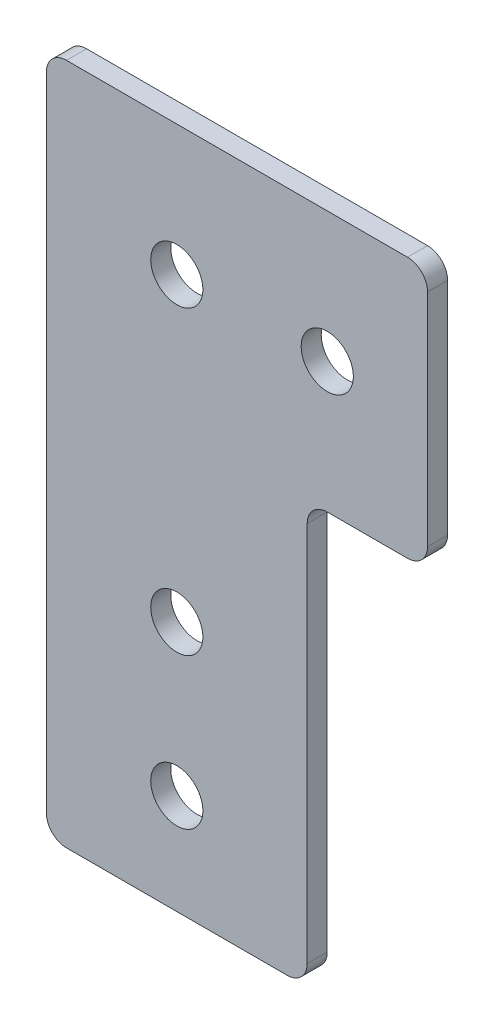
ISO-10303-21;
HEADER;
FILE_DESCRIPTION(('STEP AP214'),'2;1');
FILE_NAME('part.step','',(''),(''),'','','');
FILE_SCHEMA(('AUTOMOTIVE_DESIGN { 1 0 10303 214 1 1 1 1 }'));
ENDSEC;
DATA;
#1=APPLICATION_CONTEXT('core data for automotive mechanical design processes');
#2=APPLICATION_PROTOCOL_DEFINITION('international standard','automotive_design',2000,#1);
#3=PRODUCT_CONTEXT('',#1,'mechanical');
#4=PRODUCT('Part','Part','',(#3));
#5=PRODUCT_RELATED_PRODUCT_CATEGORY('part','',(#4));
#6=PRODUCT_DEFINITION_FORMATION('','',#4);
#7=PRODUCT_DEFINITION_CONTEXT('part definition',#1,'design');
#8=PRODUCT_DEFINITION('design','',#6,#7);
#9=PRODUCT_DEFINITION_SHAPE('','',#8);
#10=(LENGTH_UNIT() NAMED_UNIT(*) SI_UNIT(.MILLI.,.METRE.));
#11=(NAMED_UNIT(*) PLANE_ANGLE_UNIT() SI_UNIT($,.RADIAN.));
#12=(NAMED_UNIT(*) SI_UNIT($,.STERADIAN.) SOLID_ANGLE_UNIT());
#13=UNCERTAINTY_MEASURE_WITH_UNIT(LENGTH_MEASURE(1.E-05),#10,'distance_accuracy_value','');
#14=(GEOMETRIC_REPRESENTATION_CONTEXT(3) GLOBAL_UNCERTAINTY_ASSIGNED_CONTEXT((#13)) GLOBAL_UNIT_ASSIGNED_CONTEXT((#10,
#11,#12)) REPRESENTATION_CONTEXT('',''));
#15=CARTESIAN_POINT('',(0.,0.,0.));
#16=DIRECTION('',(0.,0.,1.));
#17=DIRECTION('',(1.,0.,0.));
#18=AXIS2_PLACEMENT_3D('',#15,#16,#17);
#19=CARTESIAN_POINT('',(11.,-53.,2.));
#20=DIRECTION('',(0.,0.,-1.));
#21=DIRECTION('',(-1.,0.,0.));
#22=AXIS2_PLACEMENT_3D('',#19,#20,#21);
#23=PLANE('',#22);
#24=CARTESIAN_POINT('',(0.,-45.,2.));
#25=DIRECTION('',(0.,0.,-1.));
#26=DIRECTION('',(-1.,0.,0.));
#27=AXIS2_PLACEMENT_3D('',#24,#25,#26);
#28=CIRCLE('',#27,2.6);
#29=CARTESIAN_POINT('',(-2.6,-45.,2.));
#30=VERTEX_POINT('',#29);
#31=EDGE_CURVE('E175',#30,#30,#28,.T.);
#32=ORIENTED_EDGE('',*,*,#31,.T.);
#33=EDGE_LOOP('',(#32));
#34=FACE_BOUND('',#33,.T.);
#35=CARTESIAN_POINT('',(0.,-30.,2.));
#36=DIRECTION('',(0.,0.,-1.));
#37=DIRECTION('',(-1.,0.,0.));
#38=AXIS2_PLACEMENT_3D('',#35,#36,#37);
#39=CIRCLE('',#38,2.6);
#40=CARTESIAN_POINT('',(-2.6,-30.,2.));
#41=VERTEX_POINT('',#40);
#42=EDGE_CURVE('E178',#41,#41,#39,.T.);
#43=ORIENTED_EDGE('',*,*,#42,.T.);
#44=EDGE_LOOP('',(#43));
#45=FACE_BOUND('',#44,.T.);
#46=CARTESIAN_POINT('',(15.,0.,2.));
#47=DIRECTION('',(0.,0.,-1.));
#48=DIRECTION('',(-1.,0.,0.));
#49=AXIS2_PLACEMENT_3D('',#46,#47,#48);
#50=CIRCLE('',#49,2.6);
#51=CARTESIAN_POINT('',(12.4,0.,2.));
#52=VERTEX_POINT('',#51);
#53=EDGE_CURVE('E181',#52,#52,#50,.T.);
#54=ORIENTED_EDGE('',*,*,#53,.T.);
#55=EDGE_LOOP('',(#54));
#56=FACE_BOUND('',#55,.T.);
#57=CARTESIAN_POINT('',(0.,0.,2.));
#58=DIRECTION('',(0.,0.,-1.));
#59=DIRECTION('',(-1.,0.,0.));
#60=AXIS2_PLACEMENT_3D('',#57,#58,#59);
#61=CIRCLE('',#60,2.6);
#62=CARTESIAN_POINT('',(-2.6,0.,2.));
#63=VERTEX_POINT('',#62);
#64=EDGE_CURVE('E122',#63,#63,#61,.T.);
#65=ORIENTED_EDGE('',*,*,#64,.T.);
#66=EDGE_LOOP('',(#65));
#67=FACE_BOUND('',#66,.T.);
#68=DIRECTION('',(0.,-1.,0.));
#69=VECTOR('',#68,1.);
#70=CARTESIAN_POINT('',(13.,-53.,2.));
#71=LINE('',#70,#69);
#72=CARTESIAN_POINT('',(13.,-53.,2.));
#73=VERTEX_POINT('',#72);
#74=CARTESIAN_POINT('',(13.,-15.,2.));
#75=VERTEX_POINT('',#74);
#76=EDGE_CURVE('E106',#73,#75,#71,.F.);
#77=ORIENTED_EDGE('',*,*,#76,.T.);
#78=CARTESIAN_POINT('',(15.,-15.,2.));
#79=DIRECTION('',(0.,0.,-1.));
#80=DIRECTION('',(-1.,0.,0.));
#81=AXIS2_PLACEMENT_3D('',#78,#79,#80);
#82=CIRCLE('',#81,2.);
#83=CARTESIAN_POINT('',(15.,-13.,2.));
#84=VERTEX_POINT('',#83);
#85=EDGE_CURVE('E186',#75,#84,#82,.T.);
#86=ORIENTED_EDGE('',*,*,#85,.T.);
#87=DIRECTION('',(1.,0.,0.));
#88=VECTOR('',#87,1.);
#89=CARTESIAN_POINT('',(15.,-13.,2.));
#90=LINE('',#89,#88);
#91=CARTESIAN_POINT('',(23.,-13.,2.));
#92=VERTEX_POINT('',#91);
#93=EDGE_CURVE('E128',#84,#92,#90,.T.);
#94=ORIENTED_EDGE('',*,*,#93,.T.);
#95=CARTESIAN_POINT('',(23.,-11.,2.));
#96=DIRECTION('',(0.,0.,-1.));
#97=DIRECTION('',(-1.,0.,0.));
#98=AXIS2_PLACEMENT_3D('',#95,#96,#97);
#99=CIRCLE('',#98,2.);
#100=CARTESIAN_POINT('',(25.,-11.,2.));
#101=VERTEX_POINT('',#100);
#102=EDGE_CURVE('E131',#101,#92,#99,.T.);
#103=ORIENTED_EDGE('',*,*,#102,.F.);
#104=DIRECTION('',(0.,1.,0.));
#105=VECTOR('',#104,1.);
#106=CARTESIAN_POINT('',(25.,11.,2.));
#107=LINE('',#106,#105);
#108=CARTESIAN_POINT('',(25.,11.,2.));
#109=VERTEX_POINT('',#108);
#110=EDGE_CURVE('E132',#101,#109,#107,.T.);
#111=ORIENTED_EDGE('',*,*,#110,.T.);
#112=CARTESIAN_POINT('',(23.,11.,2.));
#113=DIRECTION('',(0.,0.,-1.));
#114=DIRECTION('',(-1.,0.,0.));
#115=AXIS2_PLACEMENT_3D('',#112,#113,#114);
#116=CIRCLE('',#115,2.);
#117=CARTESIAN_POINT('',(23.,13.,2.));
#118=VERTEX_POINT('',#117);
#119=EDGE_CURVE('E135',#118,#109,#116,.T.);
#120=ORIENTED_EDGE('',*,*,#119,.F.);
#121=DIRECTION('',(1.,0.,0.));
#122=VECTOR('',#121,1.);
#123=CARTESIAN_POINT('',(-11.,13.,2.));
#124=LINE('',#123,#122);
#125=CARTESIAN_POINT('',(-11.,13.,2.));
#126=VERTEX_POINT('',#125);
#127=EDGE_CURVE('E136',#118,#126,#124,.F.);
#128=ORIENTED_EDGE('',*,*,#127,.T.);
#129=CARTESIAN_POINT('',(-11.,11.,2.));
#130=DIRECTION('',(0.,0.,-1.));
#131=DIRECTION('',(-1.,0.,0.));
#132=AXIS2_PLACEMENT_3D('',#129,#130,#131);
#133=CIRCLE('',#132,2.);
#134=CARTESIAN_POINT('',(-13.,11.,2.));
#135=VERTEX_POINT('',#134);
#136=EDGE_CURVE('E139',#135,#126,#133,.T.);
#137=ORIENTED_EDGE('',*,*,#136,.F.);
#138=DIRECTION('',(0.,1.,0.));
#139=VECTOR('',#138,1.);
#140=CARTESIAN_POINT('',(-13.,-53.,2.));
#141=LINE('',#140,#139);
#142=CARTESIAN_POINT('',(-13.,-53.,2.));
#143=VERTEX_POINT('',#142);
#144=EDGE_CURVE('E140',#135,#143,#141,.F.);
#145=ORIENTED_EDGE('',*,*,#144,.T.);
#146=CARTESIAN_POINT('',(-11.,-53.,2.));
#147=DIRECTION('',(0.,0.,-1.));
#148=DIRECTION('',(-1.,0.,0.));
#149=AXIS2_PLACEMENT_3D('',#146,#147,#148);
#150=CIRCLE('',#149,2.);
#151=CARTESIAN_POINT('',(-11.,-55.,2.));
#152=VERTEX_POINT('',#151);
#153=EDGE_CURVE('E143',#152,#143,#150,.T.);
#154=ORIENTED_EDGE('',*,*,#153,.F.);
#155=DIRECTION('',(-1.,0.,0.));
#156=VECTOR('',#155,1.);
#157=CARTESIAN_POINT('',(11.,-55.,2.));
#158=LINE('',#157,#156);
#159=CARTESIAN_POINT('',(11.,-55.,2.));
#160=VERTEX_POINT('',#159);
#161=EDGE_CURVE('E108',#152,#160,#158,.F.);
#162=ORIENTED_EDGE('',*,*,#161,.T.);
#163=CARTESIAN_POINT('',(11.,-53.,2.));
#164=DIRECTION('',(0.,0.,-1.));
#165=DIRECTION('',(-1.,0.,0.));
#166=AXIS2_PLACEMENT_3D('',#163,#164,#165);
#167=CIRCLE('',#166,2.);
#168=EDGE_CURVE('E20',#73,#160,#167,.T.);
#169=ORIENTED_EDGE('',*,*,#168,.F.);
#170=EDGE_LOOP('',(#77,#86,#94,#103,#111,#120,#128,#137,#145,#154,#162,#169));
#171=FACE_BOUND('',#170,.T.);
#172=ADVANCED_FACE('F17',(#34,#45,#56,#67,#171),#23,.F.);
#173=CARTESIAN_POINT('',(11.,-53.,2.));
#174=DIRECTION('',(0.,0.,-1.));
#175=DIRECTION('',(-1.,0.,0.));
#176=AXIS2_PLACEMENT_3D('',#173,#174,#175);
#177=CYLINDRICAL_SURFACE('',#176,2.);
#178=DIRECTION('',(0.,0.,1.));
#179=VECTOR('',#178,1.);
#180=CARTESIAN_POINT('',(13.,-53.,2.));
#181=LINE('',#180,#179);
#182=CARTESIAN_POINT('',(13.,-53.,0.));
#183=VERTEX_POINT('',#182);
#184=EDGE_CURVE('E112',#183,#73,#181,.T.);
#185=ORIENTED_EDGE('',*,*,#184,.T.);
#186=ORIENTED_EDGE('',*,*,#168,.T.);
#187=DIRECTION('',(0.,0.,1.));
#188=VECTOR('',#187,1.);
#189=CARTESIAN_POINT('',(11.,-55.,2.));
#190=LINE('',#189,#188);
#191=CARTESIAN_POINT('',(11.,-55.,0.));
#192=VERTEX_POINT('',#191);
#193=EDGE_CURVE('E126',#160,#192,#190,.F.);
#194=ORIENTED_EDGE('',*,*,#193,.T.);
#195=CARTESIAN_POINT('',(11.,-53.,0.));
#196=DIRECTION('',(0.,0.,-1.));
#197=DIRECTION('',(-1.,0.,0.));
#198=AXIS2_PLACEMENT_3D('',#195,#196,#197);
#199=CIRCLE('',#198,2.);
#200=EDGE_CURVE('E115',#183,#192,#199,.T.);
#201=ORIENTED_EDGE('',*,*,#200,.F.);
#202=EDGE_LOOP('',(#185,#186,#194,#201));
#203=FACE_BOUND('',#202,.T.);
#204=ADVANCED_FACE('F113',(#203),#177,.T.);
#205=CARTESIAN_POINT('',(11.,-55.,2.));
#206=DIRECTION('',(0.,1.,0.));
#207=DIRECTION('',(-1.,0.,0.));
#208=AXIS2_PLACEMENT_3D('',#205,#206,#207);
#209=PLANE('',#208);
#210=DIRECTION('',(-1.,0.,0.));
#211=VECTOR('',#210,1.);
#212=CARTESIAN_POINT('',(11.,-55.,0.));
#213=LINE('',#212,#211);
#214=CARTESIAN_POINT('',(-11.,-55.,0.));
#215=VERTEX_POINT('',#214);
#216=EDGE_CURVE('E173',#192,#215,#213,.T.);
#217=ORIENTED_EDGE('',*,*,#216,.F.);
#218=ORIENTED_EDGE('',*,*,#193,.F.);
#219=ORIENTED_EDGE('',*,*,#161,.F.);
#220=DIRECTION('',(0.,0.,-1.));
#221=VECTOR('',#220,1.);
#222=CARTESIAN_POINT('',(-11.,-55.,2.));
#223=LINE('',#222,#221);
#224=EDGE_CURVE('E197',#215,#152,#223,.F.);
#225=ORIENTED_EDGE('',*,*,#224,.F.);
#226=EDGE_LOOP('',(#217,#218,#219,#225));
#227=FACE_BOUND('',#226,.T.);
#228=ADVANCED_FACE('F259',(#227),#209,.F.);
#229=CARTESIAN_POINT('',(-11.,-53.,2.));
#230=DIRECTION('',(0.,0.,-1.));
#231=DIRECTION('',(-1.,0.,0.));
#232=AXIS2_PLACEMENT_3D('',#229,#230,#231);
#233=CYLINDRICAL_SURFACE('',#232,2.);
#234=ORIENTED_EDGE('',*,*,#224,.T.);
#235=ORIENTED_EDGE('',*,*,#153,.T.);
#236=DIRECTION('',(0.,0.,1.));
#237=VECTOR('',#236,1.);
#238=CARTESIAN_POINT('',(-13.,-53.,2.));
#239=LINE('',#238,#237);
#240=CARTESIAN_POINT('',(-13.,-53.,0.));
#241=VERTEX_POINT('',#240);
#242=EDGE_CURVE('E142',#143,#241,#239,.F.);
#243=ORIENTED_EDGE('',*,*,#242,.T.);
#244=CARTESIAN_POINT('',(-11.,-53.,0.));
#245=DIRECTION('',(0.,0.,-1.));
#246=DIRECTION('',(-1.,0.,0.));
#247=AXIS2_PLACEMENT_3D('',#244,#245,#246);
#248=CIRCLE('',#247,2.);
#249=EDGE_CURVE('E170',#215,#241,#248,.T.);
#250=ORIENTED_EDGE('',*,*,#249,.F.);
#251=EDGE_LOOP('',(#234,#235,#243,#250));
#252=FACE_BOUND('',#251,.T.);
#253=ADVANCED_FACE('F256',(#252),#233,.T.);
#254=CARTESIAN_POINT('',(-13.,-53.,2.));
#255=DIRECTION('',(1.,0.,0.));
#256=DIRECTION('',(0.,1.,0.));
#257=AXIS2_PLACEMENT_3D('',#254,#255,#256);
#258=PLANE('',#257);
#259=DIRECTION('',(0.,1.,0.));
#260=VECTOR('',#259,1.);
#261=CARTESIAN_POINT('',(-13.,-53.,0.));
#262=LINE('',#261,#260);
#263=CARTESIAN_POINT('',(-13.,11.,0.));
#264=VERTEX_POINT('',#263);
#265=EDGE_CURVE('E169',#241,#264,#262,.T.);
#266=ORIENTED_EDGE('',*,*,#265,.F.);
#267=ORIENTED_EDGE('',*,*,#242,.F.);
#268=ORIENTED_EDGE('',*,*,#144,.F.);
#269=DIRECTION('',(0.,0.,-1.));
#270=VECTOR('',#269,1.);
#271=CARTESIAN_POINT('',(-13.,11.,2.));
#272=LINE('',#271,#270);
#273=EDGE_CURVE('E195',#264,#135,#272,.F.);
#274=ORIENTED_EDGE('',*,*,#273,.F.);
#275=EDGE_LOOP('',(#266,#267,#268,#274));
#276=FACE_BOUND('',#275,.T.);
#277=ADVANCED_FACE('F255',(#276),#258,.F.);
#278=CARTESIAN_POINT('',(-11.,11.,2.));
#279=DIRECTION('',(0.,0.,-1.));
#280=DIRECTION('',(-1.,0.,0.));
#281=AXIS2_PLACEMENT_3D('',#278,#279,#280);
#282=CYLINDRICAL_SURFACE('',#281,2.);
#283=ORIENTED_EDGE('',*,*,#273,.T.);
#284=ORIENTED_EDGE('',*,*,#136,.T.);
#285=DIRECTION('',(0.,0.,-1.));
#286=VECTOR('',#285,1.);
#287=CARTESIAN_POINT('',(-11.,13.,2.));
#288=LINE('',#287,#286);
#289=CARTESIAN_POINT('',(-11.,13.,0.));
#290=VERTEX_POINT('',#289);
#291=EDGE_CURVE('E138',#126,#290,#288,.T.);
#292=ORIENTED_EDGE('',*,*,#291,.T.);
#293=CARTESIAN_POINT('',(-11.,11.,0.));
#294=DIRECTION('',(0.,0.,-1.));
#295=DIRECTION('',(-1.,0.,0.));
#296=AXIS2_PLACEMENT_3D('',#293,#294,#295);
#297=CIRCLE('',#296,2.);
#298=EDGE_CURVE('E166',#264,#290,#297,.T.);
#299=ORIENTED_EDGE('',*,*,#298,.F.);
#300=EDGE_LOOP('',(#283,#284,#292,#299));
#301=FACE_BOUND('',#300,.T.);
#302=ADVANCED_FACE('F251',(#301),#282,.T.);
#303=CARTESIAN_POINT('',(-11.,13.,2.));
#304=DIRECTION('',(0.,-1.,0.));
#305=DIRECTION('',(0.,0.,-1.));
#306=AXIS2_PLACEMENT_3D('',#303,#304,#305);
#307=PLANE('',#306);
#308=DIRECTION('',(-1.,0.,0.));
#309=VECTOR('',#308,1.);
#310=CARTESIAN_POINT('',(11.,13.,0.));
#311=LINE('',#310,#309);
#312=CARTESIAN_POINT('',(23.,13.,0.));
#313=VERTEX_POINT('',#312);
#314=EDGE_CURVE('E165',#290,#313,#311,.F.);
#315=ORIENTED_EDGE('',*,*,#314,.F.);
#316=ORIENTED_EDGE('',*,*,#291,.F.);
#317=ORIENTED_EDGE('',*,*,#127,.F.);
#318=DIRECTION('',(0.,0.,-1.));
#319=VECTOR('',#318,1.);
#320=CARTESIAN_POINT('',(23.,13.,2.));
#321=LINE('',#320,#319);
#322=EDGE_CURVE('E193',#313,#118,#321,.F.);
#323=ORIENTED_EDGE('',*,*,#322,.F.);
#324=EDGE_LOOP('',(#315,#316,#317,#323));
#325=FACE_BOUND('',#324,.T.);
#326=ADVANCED_FACE('F247',(#325),#307,.F.);
#327=CARTESIAN_POINT('',(23.,11.,2.));
#328=DIRECTION('',(0.,0.,-1.));
#329=DIRECTION('',(-1.,0.,0.));
#330=AXIS2_PLACEMENT_3D('',#327,#328,#329);
#331=CYLINDRICAL_SURFACE('',#330,2.);
#332=ORIENTED_EDGE('',*,*,#322,.T.);
#333=ORIENTED_EDGE('',*,*,#119,.T.);
#334=DIRECTION('',(0.,0.,1.));
#335=VECTOR('',#334,1.);
#336=CARTESIAN_POINT('',(25.,11.,2.));
#337=LINE('',#336,#335);
#338=CARTESIAN_POINT('',(25.,11.,0.));
#339=VERTEX_POINT('',#338);
#340=EDGE_CURVE('E134',#109,#339,#337,.F.);
#341=ORIENTED_EDGE('',*,*,#340,.T.);
#342=CARTESIAN_POINT('',(23.,11.,0.));
#343=DIRECTION('',(0.,0.,-1.));
#344=DIRECTION('',(-1.,0.,0.));
#345=AXIS2_PLACEMENT_3D('',#342,#343,#344);
#346=CIRCLE('',#345,2.);
#347=EDGE_CURVE('E162',#313,#339,#346,.T.);
#348=ORIENTED_EDGE('',*,*,#347,.F.);
#349=EDGE_LOOP('',(#332,#333,#341,#348));
#350=FACE_BOUND('',#349,.T.);
#351=ADVANCED_FACE('F243',(#350),#331,.T.);
#352=CARTESIAN_POINT('',(25.,11.,2.));
#353=DIRECTION('',(-1.,0.,0.));
#354=DIRECTION('',(0.,0.,1.));
#355=AXIS2_PLACEMENT_3D('',#352,#353,#354);
#356=PLANE('',#355);
#357=DIRECTION('',(0.,1.,0.));
#358=VECTOR('',#357,1.);
#359=CARTESIAN_POINT('',(25.,-53.,0.));
#360=LINE('',#359,#358);
#361=CARTESIAN_POINT('',(25.,-11.,0.));
#362=VERTEX_POINT('',#361);
#363=EDGE_CURVE('E161',#339,#362,#360,.F.);
#364=ORIENTED_EDGE('',*,*,#363,.F.);
#365=ORIENTED_EDGE('',*,*,#340,.F.);
#366=ORIENTED_EDGE('',*,*,#110,.F.);
#367=DIRECTION('',(0.,0.,-1.));
#368=VECTOR('',#367,1.);
#369=CARTESIAN_POINT('',(25.,-11.,2.));
#370=LINE('',#369,#368);
#371=EDGE_CURVE('E190',#362,#101,#370,.F.);
#372=ORIENTED_EDGE('',*,*,#371,.F.);
#373=EDGE_LOOP('',(#364,#365,#366,#372));
#374=FACE_BOUND('',#373,.T.);
#375=ADVANCED_FACE('F239',(#374),#356,.F.);
#376=CARTESIAN_POINT('',(23.,-11.,2.));
#377=DIRECTION('',(0.,0.,-1.));
#378=DIRECTION('',(-1.,0.,0.));
#379=AXIS2_PLACEMENT_3D('',#376,#377,#378);
#380=CYLINDRICAL_SURFACE('',#379,2.);
#381=ORIENTED_EDGE('',*,*,#371,.T.);
#382=ORIENTED_EDGE('',*,*,#102,.T.);
#383=DIRECTION('',(0.,0.,1.));
#384=VECTOR('',#383,1.);
#385=CARTESIAN_POINT('',(23.,-13.,2.));
#386=LINE('',#385,#384);
#387=CARTESIAN_POINT('',(23.,-13.,0.));
#388=VERTEX_POINT('',#387);
#389=EDGE_CURVE('E130',#92,#388,#386,.F.);
#390=ORIENTED_EDGE('',*,*,#389,.T.);
#391=CARTESIAN_POINT('',(23.,-11.,0.));
#392=DIRECTION('',(0.,0.,-1.));
#393=DIRECTION('',(-1.,0.,0.));
#394=AXIS2_PLACEMENT_3D('',#391,#392,#393);
#395=CIRCLE('',#394,2.);
#396=EDGE_CURVE('E158',#362,#388,#395,.T.);
#397=ORIENTED_EDGE('',*,*,#396,.F.);
#398=EDGE_LOOP('',(#381,#382,#390,#397));
#399=FACE_BOUND('',#398,.T.);
#400=ADVANCED_FACE('F235',(#399),#380,.T.);
#401=CARTESIAN_POINT('',(15.,-13.,2.));
#402=DIRECTION('',(0.,1.,0.));
#403=DIRECTION('',(0.,0.,1.));
#404=AXIS2_PLACEMENT_3D('',#401,#402,#403);
#405=PLANE('',#404);
#406=DIRECTION('',(-1.,0.,0.));
#407=VECTOR('',#406,1.);
#408=CARTESIAN_POINT('',(11.,-13.,0.));
#409=LINE('',#408,#407);
#410=CARTESIAN_POINT('',(15.,-13.,0.));
#411=VERTEX_POINT('',#410);
#412=EDGE_CURVE('E157',#388,#411,#409,.T.);
#413=ORIENTED_EDGE('',*,*,#412,.F.);
#414=ORIENTED_EDGE('',*,*,#389,.F.);
#415=ORIENTED_EDGE('',*,*,#93,.F.);
#416=DIRECTION('',(0.,0.,-1.));
#417=VECTOR('',#416,1.);
#418=CARTESIAN_POINT('',(15.,-13.,2.));
#419=LINE('',#418,#417);
#420=EDGE_CURVE('E118',#84,#411,#419,.T.);
#421=ORIENTED_EDGE('',*,*,#420,.T.);
#422=EDGE_LOOP('',(#413,#414,#415,#421));
#423=FACE_BOUND('',#422,.T.);
#424=ADVANCED_FACE('F231',(#423),#405,.F.);
#425=CARTESIAN_POINT('',(15.,-15.,2.));
#426=DIRECTION('',(0.,0.,-1.));
#427=DIRECTION('',(-1.,0.,0.));
#428=AXIS2_PLACEMENT_3D('',#425,#426,#427);
#429=CYLINDRICAL_SURFACE('',#428,2.);
#430=CARTESIAN_POINT('',(15.,-15.,0.));
#431=DIRECTION('',(0.,0.,-1.));
#432=DIRECTION('',(-1.,0.,0.));
#433=AXIS2_PLACEMENT_3D('',#430,#431,#432);
#434=CIRCLE('',#433,2.);
#435=CARTESIAN_POINT('',(13.,-15.,0.));
#436=VERTEX_POINT('',#435);
#437=EDGE_CURVE('E154',#411,#436,#434,.F.);
#438=ORIENTED_EDGE('',*,*,#437,.F.);
#439=ORIENTED_EDGE('',*,*,#420,.F.);
#440=ORIENTED_EDGE('',*,*,#85,.F.);
#441=DIRECTION('',(0.,0.,1.));
#442=VECTOR('',#441,1.);
#443=CARTESIAN_POINT('',(13.,-15.,2.));
#444=LINE('',#443,#442);
#445=EDGE_CURVE('E35',#75,#436,#444,.F.);
#446=ORIENTED_EDGE('',*,*,#445,.T.);
#447=EDGE_LOOP('',(#438,#439,#440,#446));
#448=FACE_BOUND('',#447,.T.);
#449=ADVANCED_FACE('F228',(#448),#429,.F.);
#450=CARTESIAN_POINT('',(13.,-53.,2.));
#451=DIRECTION('',(-1.,0.,0.));
#452=DIRECTION('',(0.,-1.,0.));
#453=AXIS2_PLACEMENT_3D('',#450,#451,#452);
#454=PLANE('',#453);
#455=ORIENTED_EDGE('',*,*,#445,.F.);
#456=ORIENTED_EDGE('',*,*,#76,.F.);
#457=ORIENTED_EDGE('',*,*,#184,.F.);
#458=DIRECTION('',(0.,1.,0.));
#459=VECTOR('',#458,1.);
#460=CARTESIAN_POINT('',(13.,-53.,0.));
#461=LINE('',#460,#459);
#462=EDGE_CURVE('E153',#436,#183,#461,.F.);
#463=ORIENTED_EDGE('',*,*,#462,.F.);
#464=EDGE_LOOP('',(#455,#456,#457,#463));
#465=FACE_BOUND('',#464,.T.);
#466=ADVANCED_FACE('F120',(#465),#454,.F.);
#467=CARTESIAN_POINT('',(0.,0.,2.));
#468=DIRECTION('',(0.,0.,-1.));
#469=DIRECTION('',(-1.,0.,0.));
#470=AXIS2_PLACEMENT_3D('',#467,#468,#469);
#471=CYLINDRICAL_SURFACE('',#470,2.6);
#472=ORIENTED_EDGE('',*,*,#64,.F.);
#473=EDGE_LOOP('',(#472));
#474=FACE_BOUND('',#473,.T.);
#475=CARTESIAN_POINT('',(0.,0.,0.));
#476=DIRECTION('',(0.,0.,-1.));
#477=DIRECTION('',(-1.,0.,0.));
#478=AXIS2_PLACEMENT_3D('',#475,#476,#477);
#479=CIRCLE('',#478,2.6);
#480=CARTESIAN_POINT('',(-2.6,0.,0.));
#481=VERTEX_POINT('',#480);
#482=EDGE_CURVE('E150',#481,#481,#479,.F.);
#483=ORIENTED_EDGE('',*,*,#482,.F.);
#484=EDGE_LOOP('',(#483));
#485=FACE_BOUND('',#484,.T.);
#486=ADVANCED_FACE('F286',(#474,#485),#471,.F.);
#487=CARTESIAN_POINT('',(15.,0.,2.));
#488=DIRECTION('',(0.,0.,-1.));
#489=DIRECTION('',(-1.,0.,0.));
#490=AXIS2_PLACEMENT_3D('',#487,#488,#489);
#491=CYLINDRICAL_SURFACE('',#490,2.6);
#492=ORIENTED_EDGE('',*,*,#53,.F.);
#493=EDGE_LOOP('',(#492));
#494=FACE_BOUND('',#493,.T.);
#495=CARTESIAN_POINT('',(15.,0.,0.));
#496=DIRECTION('',(0.,0.,-1.));
#497=DIRECTION('',(-1.,0.,0.));
#498=AXIS2_PLACEMENT_3D('',#495,#496,#497);
#499=CIRCLE('',#498,2.6);
#500=CARTESIAN_POINT('',(12.4,0.,0.));
#501=VERTEX_POINT('',#500);
#502=EDGE_CURVE('E147',#501,#501,#499,.F.);
#503=ORIENTED_EDGE('',*,*,#502,.F.);
#504=EDGE_LOOP('',(#503));
#505=FACE_BOUND('',#504,.T.);
#506=ADVANCED_FACE('F282',(#494,#505),#491,.F.);
#507=CARTESIAN_POINT('',(0.,-30.,2.));
#508=DIRECTION('',(0.,0.,-1.));
#509=DIRECTION('',(-1.,0.,0.));
#510=AXIS2_PLACEMENT_3D('',#507,#508,#509);
#511=CYLINDRICAL_SURFACE('',#510,2.6);
#512=ORIENTED_EDGE('',*,*,#42,.F.);
#513=EDGE_LOOP('',(#512));
#514=FACE_BOUND('',#513,.T.);
#515=CARTESIAN_POINT('',(0.,-30.,0.));
#516=DIRECTION('',(0.,0.,-1.));
#517=DIRECTION('',(-1.,0.,0.));
#518=AXIS2_PLACEMENT_3D('',#515,#516,#517);
#519=CIRCLE('',#518,2.6);
#520=CARTESIAN_POINT('',(-2.6,-30.,0.));
#521=VERTEX_POINT('',#520);
#522=EDGE_CURVE('E26',#521,#521,#519,.F.);
#523=ORIENTED_EDGE('',*,*,#522,.F.);
#524=EDGE_LOOP('',(#523));
#525=FACE_BOUND('',#524,.T.);
#526=ADVANCED_FACE('F275',(#514,#525),#511,.F.);
#527=CARTESIAN_POINT('',(0.,-45.,2.));
#528=DIRECTION('',(0.,0.,-1.));
#529=DIRECTION('',(-1.,0.,0.));
#530=AXIS2_PLACEMENT_3D('',#527,#528,#529);
#531=CYLINDRICAL_SURFACE('',#530,2.6);
#532=ORIENTED_EDGE('',*,*,#31,.F.);
#533=EDGE_LOOP('',(#532));
#534=FACE_BOUND('',#533,.T.);
#535=CARTESIAN_POINT('',(0.,-45.,0.));
#536=DIRECTION('',(0.,0.,-1.));
#537=DIRECTION('',(-1.,0.,0.));
#538=AXIS2_PLACEMENT_3D('',#535,#536,#537);
#539=CIRCLE('',#538,2.6);
#540=CARTESIAN_POINT('',(-2.6,-45.,0.));
#541=VERTEX_POINT('',#540);
#542=EDGE_CURVE('E11',#541,#541,#539,.F.);
#543=ORIENTED_EDGE('',*,*,#542,.F.);
#544=EDGE_LOOP('',(#543));
#545=FACE_BOUND('',#544,.T.);
#546=ADVANCED_FACE('F269',(#534,#545),#531,.F.);
#547=CARTESIAN_POINT('',(11.,-53.,0.));
#548=DIRECTION('',(0.,0.,-1.));
#549=DIRECTION('',(-1.,0.,0.));
#550=AXIS2_PLACEMENT_3D('',#547,#548,#549);
#551=PLANE('',#550);
#552=ORIENTED_EDGE('',*,*,#542,.T.);
#553=EDGE_LOOP('',(#552));
#554=FACE_BOUND('',#553,.T.);
#555=ORIENTED_EDGE('',*,*,#522,.T.);
#556=EDGE_LOOP('',(#555));
#557=FACE_BOUND('',#556,.T.);
#558=ORIENTED_EDGE('',*,*,#502,.T.);
#559=EDGE_LOOP('',(#558));
#560=FACE_BOUND('',#559,.T.);
#561=ORIENTED_EDGE('',*,*,#482,.T.);
#562=EDGE_LOOP('',(#561));
#563=FACE_BOUND('',#562,.T.);
#564=ORIENTED_EDGE('',*,*,#437,.T.);
#565=ORIENTED_EDGE('',*,*,#462,.T.);
#566=ORIENTED_EDGE('',*,*,#200,.T.);
#567=ORIENTED_EDGE('',*,*,#216,.T.);
#568=ORIENTED_EDGE('',*,*,#249,.T.);
#569=ORIENTED_EDGE('',*,*,#265,.T.);
#570=ORIENTED_EDGE('',*,*,#298,.T.);
#571=ORIENTED_EDGE('',*,*,#314,.T.);
#572=ORIENTED_EDGE('',*,*,#347,.T.);
#573=ORIENTED_EDGE('',*,*,#363,.T.);
#574=ORIENTED_EDGE('',*,*,#396,.T.);
#575=ORIENTED_EDGE('',*,*,#412,.T.);
#576=EDGE_LOOP('',(#564,#565,#566,#567,#568,#569,#570,#571,#572,#573,#574,#575));
#577=FACE_BOUND('',#576,.T.);
#578=ADVANCED_FACE('F225',(#554,#557,#560,#563,#577),#551,.T.);
#579=CLOSED_SHELL('',(#172,#204,#228,#253,#277,#302,#326,#351,#375,#400,#424,#449,#466,#486,
#506,#526,#546,#578));
#580=MANIFOLD_SOLID_BREP('B1',#579);
#581=ADVANCED_BREP_SHAPE_REPRESENTATION('',(#18,#580),#14);
#582=SHAPE_DEFINITION_REPRESENTATION(#9,#581);
ENDSEC;
END-ISO-10303-21;
